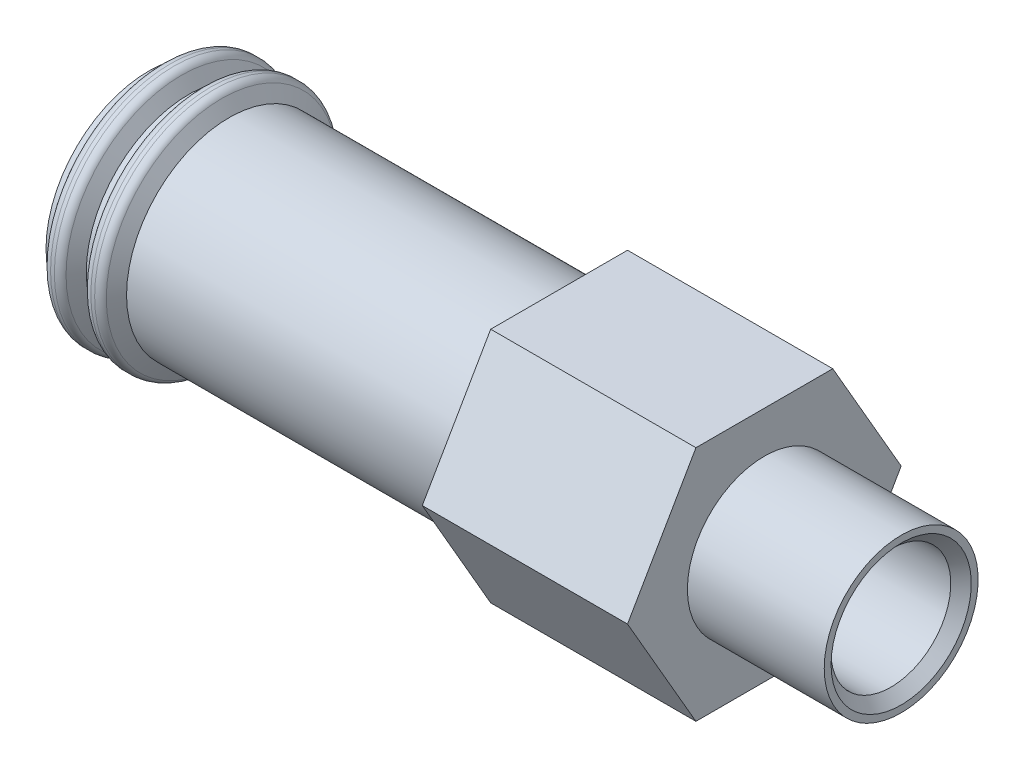
ISO-10303-21;
HEADER;
FILE_DESCRIPTION(('STEP AP214'),'2;1');
FILE_NAME('part.step','',(''),(''),'','','');
FILE_SCHEMA(('AUTOMOTIVE_DESIGN { 1 0 10303 214 1 1 1 1 }'));
ENDSEC;
DATA;
#1=APPLICATION_CONTEXT('core data for automotive mechanical design processes');
#2=APPLICATION_PROTOCOL_DEFINITION('international standard','automotive_design',2000,#1);
#3=PRODUCT_CONTEXT('',#1,'mechanical');
#4=PRODUCT('Part','Part','',(#3));
#5=PRODUCT_RELATED_PRODUCT_CATEGORY('part','',(#4));
#6=PRODUCT_DEFINITION_FORMATION('','',#4);
#7=PRODUCT_DEFINITION_CONTEXT('part definition',#1,'design');
#8=PRODUCT_DEFINITION('design','',#6,#7);
#9=PRODUCT_DEFINITION_SHAPE('','',#8);
#10=(LENGTH_UNIT() NAMED_UNIT(*) SI_UNIT(.MILLI.,.METRE.));
#11=(NAMED_UNIT(*) PLANE_ANGLE_UNIT() SI_UNIT($,.RADIAN.));
#12=(NAMED_UNIT(*) SI_UNIT($,.STERADIAN.) SOLID_ANGLE_UNIT());
#13=UNCERTAINTY_MEASURE_WITH_UNIT(LENGTH_MEASURE(1.E-05),#10,'distance_accuracy_value','');
#14=(GEOMETRIC_REPRESENTATION_CONTEXT(3) GLOBAL_UNCERTAINTY_ASSIGNED_CONTEXT((#13)) GLOBAL_UNIT_ASSIGNED_CONTEXT((#10,
#11,#12)) REPRESENTATION_CONTEXT('',''));
#15=CARTESIAN_POINT('',(0.,0.,0.));
#16=DIRECTION('',(0.,0.,1.));
#17=DIRECTION('',(1.,0.,0.));
#18=AXIS2_PLACEMENT_3D('',#15,#16,#17);
#19=CARTESIAN_POINT('',(3.5,4.,0.));
#20=DIRECTION('',(-1.,0.,0.));
#21=DIRECTION('',(0.,0.,1.));
#22=AXIS2_PLACEMENT_3D('',#19,#20,#21);
#23=PLANE('',#22);
#24=CARTESIAN_POINT('',(3.5,0.,0.));
#25=DIRECTION('',(-1.,0.,0.));
#26=DIRECTION('',(0.,0.,1.));
#27=AXIS2_PLACEMENT_3D('',#24,#25,#26);
#28=CIRCLE('',#27,2.25);
#29=CARTESIAN_POINT('',(3.5,0.,2.25));
#30=VERTEX_POINT('',#29);
#31=EDGE_CURVE('E144',#30,#30,#28,.T.);
#32=ORIENTED_EDGE('',*,*,#31,.T.);
#33=EDGE_LOOP('',(#32));
#34=FACE_BOUND('',#33,.T.);
#35=DIRECTION('',(0.,0.866025403784438,0.500000000000001));
#36=VECTOR('',#35,1.);
#37=CARTESIAN_POINT('',(3.5,1.73205080756888,-3.));
#38=LINE('',#37,#36);
#39=CARTESIAN_POINT('',(3.5,0.,-4.));
#40=VERTEX_POINT('',#39);
#41=CARTESIAN_POINT('',(3.5,3.46410161513776,-1.99999999999999));
#42=VERTEX_POINT('',#41);
#43=EDGE_CURVE('E110',#40,#42,#38,.T.);
#44=ORIENTED_EDGE('',*,*,#43,.T.);
#45=DIRECTION('',(0.,0.,1.));
#46=VECTOR('',#45,1.);
#47=CARTESIAN_POINT('',(3.5,3.46410161513775,0.));
#48=LINE('',#47,#46);
#49=CARTESIAN_POINT('',(3.5,3.46410161513775,2.00000000000002));
#50=VERTEX_POINT('',#49);
#51=EDGE_CURVE('E118',#42,#50,#48,.T.);
#52=ORIENTED_EDGE('',*,*,#51,.T.);
#53=DIRECTION('',(0.,-0.866025403784442,0.499999999999995));
#54=VECTOR('',#53,1.);
#55=CARTESIAN_POINT('',(3.5,1.73205080756886,3.00000000000001));
#56=LINE('',#55,#54);
#57=CARTESIAN_POINT('',(3.5,0.,4.));
#58=VERTEX_POINT('',#57);
#59=EDGE_CURVE('E62',#50,#58,#56,.T.);
#60=ORIENTED_EDGE('',*,*,#59,.T.);
#61=DIRECTION('',(0.,-0.866025403784435,-0.500000000000007));
#62=VECTOR('',#61,1.);
#63=CARTESIAN_POINT('',(3.5,-1.7320508075689,2.99999999999998));
#64=LINE('',#63,#62);
#65=CARTESIAN_POINT('',(3.5,-3.46410161513777,1.99999999999997));
#66=VERTEX_POINT('',#65);
#67=EDGE_CURVE('E498',#58,#66,#64,.T.);
#68=ORIENTED_EDGE('',*,*,#67,.T.);
#69=DIRECTION('',(0.,0.,-1.));
#70=VECTOR('',#69,1.);
#71=CARTESIAN_POINT('',(3.5,-3.46410161513775,0.));
#72=LINE('',#71,#70);
#73=CARTESIAN_POINT('',(3.5,-3.46410161513773,-2.00000000000004));
#74=VERTEX_POINT('',#73);
#75=EDGE_CURVE('E487',#66,#74,#72,.T.);
#76=ORIENTED_EDGE('',*,*,#75,.T.);
#77=DIRECTION('',(0.,0.866025403784442,-0.499999999999995));
#78=VECTOR('',#77,1.);
#79=CARTESIAN_POINT('',(3.5,-1.73205080756887,-3.00000000000002));
#80=LINE('',#79,#78);
#81=EDGE_CURVE('E480',#74,#40,#80,.T.);
#82=ORIENTED_EDGE('',*,*,#81,.T.);
#83=EDGE_LOOP('',(#44,#52,#60,#68,#76,#82));
#84=FACE_BOUND('',#83,.T.);
#85=ADVANCED_FACE('F47',(#34,#84),#23,.F.);
#86=CARTESIAN_POINT('',(-2.5,3.,0.));
#87=DIRECTION('',(1.,0.,0.));
#88=DIRECTION('',(0.,0.,-1.));
#89=AXIS2_PLACEMENT_3D('',#86,#87,#88);
#90=PLANE('',#89);
#91=CARTESIAN_POINT('',(-2.5,0.,0.));
#92=DIRECTION('',(-1.,0.,0.));
#93=DIRECTION('',(0.,0.,1.));
#94=AXIS2_PLACEMENT_3D('',#91,#92,#93);
#95=CIRCLE('',#94,3.);
#96=CARTESIAN_POINT('',(-2.5,0.,3.));
#97=VERTEX_POINT('',#96);
#98=EDGE_CURVE('E141',#97,#97,#95,.T.);
#99=ORIENTED_EDGE('',*,*,#98,.F.);
#100=EDGE_LOOP('',(#99));
#101=FACE_BOUND('',#100,.T.);
#102=DIRECTION('',(0.,-0.866025403784438,-0.500000000000001));
#103=VECTOR('',#102,1.);
#104=CARTESIAN_POINT('',(-2.5,1.73205080756888,-3.));
#105=LINE('',#104,#103);
#106=CARTESIAN_POINT('',(-2.5,3.46410161513776,-1.99999999999999));
#107=VERTEX_POINT('',#106);
#108=CARTESIAN_POINT('',(-2.5,0.,-4.));
#109=VERTEX_POINT('',#108);
#110=EDGE_CURVE('E99',#107,#109,#105,.T.);
#111=ORIENTED_EDGE('',*,*,#110,.T.);
#112=DIRECTION('',(0.,-0.866025403784442,0.499999999999995));
#113=VECTOR('',#112,1.);
#114=CARTESIAN_POINT('',(-2.5,-1.73205080756887,-3.00000000000002));
#115=LINE('',#114,#113);
#116=CARTESIAN_POINT('',(-2.5,-3.46410161513773,-2.00000000000004));
#117=VERTEX_POINT('',#116);
#118=EDGE_CURVE('E482',#109,#117,#115,.T.);
#119=ORIENTED_EDGE('',*,*,#118,.T.);
#120=DIRECTION('',(0.,0.,1.));
#121=VECTOR('',#120,1.);
#122=CARTESIAN_POINT('',(-2.5,-3.46410161513775,0.));
#123=LINE('',#122,#121);
#124=CARTESIAN_POINT('',(-2.5,-3.46410161513777,1.99999999999997));
#125=VERTEX_POINT('',#124);
#126=EDGE_CURVE('E483',#117,#125,#123,.T.);
#127=ORIENTED_EDGE('',*,*,#126,.T.);
#128=DIRECTION('',(0.,0.866025403784435,0.500000000000007));
#129=VECTOR('',#128,1.);
#130=CARTESIAN_POINT('',(-2.5,-1.7320508075689,2.99999999999998));
#131=LINE('',#130,#129);
#132=CARTESIAN_POINT('',(-2.5,0.,4.));
#133=VERTEX_POINT('',#132);
#134=EDGE_CURVE('E496',#125,#133,#131,.T.);
#135=ORIENTED_EDGE('',*,*,#134,.T.);
#136=DIRECTION('',(0.,0.866025403784442,-0.499999999999995));
#137=VECTOR('',#136,1.);
#138=CARTESIAN_POINT('',(-2.5,1.73205080756886,3.00000000000001));
#139=LINE('',#138,#137);
#140=CARTESIAN_POINT('',(-2.5,3.46410161513775,2.00000000000002));
#141=VERTEX_POINT('',#140);
#142=EDGE_CURVE('E122',#133,#141,#139,.T.);
#143=ORIENTED_EDGE('',*,*,#142,.T.);
#144=DIRECTION('',(0.,0.,-1.));
#145=VECTOR('',#144,1.);
#146=CARTESIAN_POINT('',(-2.5,3.46410161513775,0.));
#147=LINE('',#146,#145);
#148=EDGE_CURVE('E116',#141,#107,#147,.T.);
#149=ORIENTED_EDGE('',*,*,#148,.T.);
#150=EDGE_LOOP('',(#111,#119,#127,#135,#143,#149));
#151=FACE_BOUND('',#150,.T.);
#152=ADVANCED_FACE('F120',(#101,#151),#90,.F.);
#153=CARTESIAN_POINT('',(-29.7219053344211,0.,0.));
#154=DIRECTION('',(-1.,0.,0.));
#155=DIRECTION('',(0.,0.,1.));
#156=AXIS2_PLACEMENT_3D('',#153,#154,#155);
#157=CYLINDRICAL_SURFACE('',#156,3.);
#158=CARTESIAN_POINT('',(-14.5,0.,0.));
#159=DIRECTION('',(-1.,0.,0.));
#160=DIRECTION('',(0.,0.,1.));
#161=AXIS2_PLACEMENT_3D('',#158,#159,#160);
#162=CIRCLE('',#161,3.);
#163=CARTESIAN_POINT('',(-14.5,0.,3.));
#164=VERTEX_POINT('',#163);
#165=EDGE_CURVE('E159',#164,#164,#162,.T.);
#166=ORIENTED_EDGE('',*,*,#165,.F.);
#167=EDGE_LOOP('',(#166));
#168=FACE_BOUND('',#167,.T.);
#169=CARTESIAN_POINT('',(-14.3,0.,0.));
#170=DIRECTION('',(-1.,0.,0.));
#171=DIRECTION('',(0.,0.,1.));
#172=AXIS2_PLACEMENT_3D('',#169,#170,#171);
#173=CIRCLE('',#172,3.);
#174=CARTESIAN_POINT('',(-14.3,0.,3.));
#175=VERTEX_POINT('',#174);
#176=EDGE_CURVE('E129',#175,#175,#173,.T.);
#177=ORIENTED_EDGE('',*,*,#176,.T.);
#178=EDGE_LOOP('',(#177));
#179=FACE_BOUND('',#178,.T.);
#180=ADVANCED_FACE('F206',(#168,#179),#157,.T.);
#181=CARTESIAN_POINT('',(-14.5,2.5,0.));
#182=DIRECTION('',(1.,0.,0.));
#183=DIRECTION('',(0.,0.,-1.));
#184=AXIS2_PLACEMENT_3D('',#181,#182,#183);
#185=PLANE('',#184);
#186=CARTESIAN_POINT('',(-14.5,0.,0.));
#187=DIRECTION('',(-1.,0.,0.));
#188=DIRECTION('',(0.,0.,1.));
#189=AXIS2_PLACEMENT_3D('',#186,#187,#188);
#190=CIRCLE('',#189,2.5);
#191=CARTESIAN_POINT('',(-14.5,0.,2.5));
#192=VERTEX_POINT('',#191);
#193=EDGE_CURVE('E156',#192,#192,#190,.T.);
#194=ORIENTED_EDGE('',*,*,#193,.F.);
#195=EDGE_LOOP('',(#194));
#196=FACE_BOUND('',#195,.T.);
#197=ORIENTED_EDGE('',*,*,#165,.T.);
#198=EDGE_LOOP('',(#197));
#199=FACE_BOUND('',#198,.T.);
#200=ADVANCED_FACE('F230',(#196,#199),#185,.F.);
#201=CARTESIAN_POINT('',(-29.7219053344211,0.,0.));
#202=DIRECTION('',(-1.,0.,0.));
#203=DIRECTION('',(0.,0.,1.));
#204=AXIS2_PLACEMENT_3D('',#201,#202,#203);
#205=CYLINDRICAL_SURFACE('',#204,2.5);
#206=CARTESIAN_POINT('',(-10.5,0.,0.));
#207=DIRECTION('',(-1.,0.,0.));
#208=DIRECTION('',(0.,0.,1.));
#209=AXIS2_PLACEMENT_3D('',#206,#207,#208);
#210=CIRCLE('',#209,2.5);
#211=CARTESIAN_POINT('',(-10.5,0.,2.5));
#212=VERTEX_POINT('',#211);
#213=EDGE_CURVE('E153',#212,#212,#210,.T.);
#214=ORIENTED_EDGE('',*,*,#213,.F.);
#215=EDGE_LOOP('',(#214));
#216=FACE_BOUND('',#215,.T.);
#217=ORIENTED_EDGE('',*,*,#193,.T.);
#218=EDGE_LOOP('',(#217));
#219=FACE_BOUND('',#218,.T.);
#220=ADVANCED_FACE('F226',(#216,#219),#205,.F.);
#221=CARTESIAN_POINT('',(-10.5,0.,0.));
#222=DIRECTION('',(-1.,0.,0.));
#223=DIRECTION('',(0.,0.,1.));
#224=AXIS2_PLACEMENT_3D('',#221,#222,#223);
#225=CONICAL_SURFACE('',#224,2.5,0.523598775598293);
#226=CARTESIAN_POINT('',(-9.20096189432332,0.,0.));
#227=DIRECTION('',(-1.,0.,0.));
#228=DIRECTION('',(0.,0.,1.));
#229=AXIS2_PLACEMENT_3D('',#226,#227,#228);
#230=CIRCLE('',#229,1.75);
#231=CARTESIAN_POINT('',(-9.20096189432332,0.,1.75));
#232=VERTEX_POINT('',#231);
#233=EDGE_CURVE('E150',#232,#232,#230,.T.);
#234=ORIENTED_EDGE('',*,*,#233,.F.);
#235=EDGE_LOOP('',(#234));
#236=FACE_BOUND('',#235,.T.);
#237=ORIENTED_EDGE('',*,*,#213,.T.);
#238=EDGE_LOOP('',(#237));
#239=FACE_BOUND('',#238,.T.);
#240=ADVANCED_FACE('F222',(#236,#239),#225,.F.);
#241=CARTESIAN_POINT('',(-29.7219053344211,0.,0.));
#242=DIRECTION('',(-1.,0.,0.));
#243=DIRECTION('',(0.,0.,1.));
#244=AXIS2_PLACEMENT_3D('',#241,#242,#243);
#245=CYLINDRICAL_SURFACE('',#244,1.75);
#246=CARTESIAN_POINT('',(7.2,0.,0.));
#247=DIRECTION('',(-1.,0.,0.));
#248=DIRECTION('',(0.,0.,1.));
#249=AXIS2_PLACEMENT_3D('',#246,#247,#248);
#250=CIRCLE('',#249,1.75);
#251=CARTESIAN_POINT('',(7.2,0.,1.75));
#252=VERTEX_POINT('',#251);
#253=EDGE_CURVE('E12',#252,#252,#250,.F.);
#254=ORIENTED_EDGE('',*,*,#253,.T.);
#255=EDGE_LOOP('',(#254));
#256=FACE_BOUND('',#255,.T.);
#257=ORIENTED_EDGE('',*,*,#233,.T.);
#258=EDGE_LOOP('',(#257));
#259=FACE_BOUND('',#258,.T.);
#260=ADVANCED_FACE('F219',(#256,#259),#245,.F.);
#261=CARTESIAN_POINT('',(7.5,2.25,0.));
#262=DIRECTION('',(-1.,0.,0.));
#263=DIRECTION('',(0.,0.,1.));
#264=AXIS2_PLACEMENT_3D('',#261,#262,#263);
#265=PLANE('',#264);
#266=CARTESIAN_POINT('',(7.5,0.,0.));
#267=DIRECTION('',(-1.,0.,0.));
#268=DIRECTION('',(0.,0.,1.));
#269=AXIS2_PLACEMENT_3D('',#266,#267,#268);
#270=CIRCLE('',#269,2.05);
#271=CARTESIAN_POINT('',(7.5,0.,2.05));
#272=VERTEX_POINT('',#271);
#273=EDGE_CURVE('E55',#272,#272,#270,.T.);
#274=ORIENTED_EDGE('',*,*,#273,.T.);
#275=EDGE_LOOP('',(#274));
#276=FACE_BOUND('',#275,.T.);
#277=CARTESIAN_POINT('',(7.5,0.,0.));
#278=DIRECTION('',(-1.,0.,0.));
#279=DIRECTION('',(0.,0.,1.));
#280=AXIS2_PLACEMENT_3D('',#277,#278,#279);
#281=CIRCLE('',#280,2.25);
#282=CARTESIAN_POINT('',(7.5,0.,2.25));
#283=VERTEX_POINT('',#282);
#284=EDGE_CURVE('E147',#283,#283,#281,.T.);
#285=ORIENTED_EDGE('',*,*,#284,.F.);
#286=EDGE_LOOP('',(#285));
#287=FACE_BOUND('',#286,.T.);
#288=ADVANCED_FACE('F188',(#276,#287),#265,.F.);
#289=CARTESIAN_POINT('',(-29.7219053344211,0.,0.));
#290=DIRECTION('',(-1.,0.,0.));
#291=DIRECTION('',(0.,0.,1.));
#292=AXIS2_PLACEMENT_3D('',#289,#290,#291);
#293=CYLINDRICAL_SURFACE('',#292,2.25);
#294=ORIENTED_EDGE('',*,*,#31,.F.);
#295=EDGE_LOOP('',(#294));
#296=FACE_BOUND('',#295,.T.);
#297=ORIENTED_EDGE('',*,*,#284,.T.);
#298=EDGE_LOOP('',(#297));
#299=FACE_BOUND('',#298,.T.);
#300=ADVANCED_FACE('F212',(#296,#299),#293,.T.);
#301=CARTESIAN_POINT('',(-29.7219053344211,0.,0.));
#302=DIRECTION('',(-1.,0.,0.));
#303=DIRECTION('',(0.,0.,1.));
#304=AXIS2_PLACEMENT_3D('',#301,#302,#303);
#305=CYLINDRICAL_SURFACE('',#304,3.);
#306=CARTESIAN_POINT('',(-12.1452994616208,0.,0.));
#307=DIRECTION('',(-1.,0.,0.));
#308=DIRECTION('',(0.,0.,1.));
#309=AXIS2_PLACEMENT_3D('',#306,#307,#308);
#310=CIRCLE('',#309,3.);
#311=CARTESIAN_POINT('',(-12.1452994616208,0.,3.));
#312=VERTEX_POINT('',#311);
#313=EDGE_CURVE('E138',#312,#312,#310,.T.);
#314=ORIENTED_EDGE('',*,*,#313,.F.);
#315=EDGE_LOOP('',(#314));
#316=FACE_BOUND('',#315,.T.);
#317=ORIENTED_EDGE('',*,*,#98,.T.);
#318=EDGE_LOOP('',(#317));
#319=FACE_BOUND('',#318,.T.);
#320=ADVANCED_FACE('F215',(#316,#319),#305,.T.);
#321=CARTESIAN_POINT('',(-12.1452994616208,0.,0.));
#322=DIRECTION('',(-1.,0.,0.));
#323=DIRECTION('',(0.,0.,1.));
#324=AXIS2_PLACEMENT_3D('',#321,#322,#323);
#325=CONICAL_SURFACE('',#324,3.,1.0471975511966);
#326=CARTESIAN_POINT('',(-12.3618058125669,0.,0.));
#327=DIRECTION('',(1.,0.,0.));
#328=DIRECTION('',(0.,0.,-1.));
#329=AXIS2_PLACEMENT_3D('',#326,#327,#328);
#330=CIRCLE('',#329,3.375);
#331=CARTESIAN_POINT('',(-12.3618058125669,0.,-3.375));
#332=VERTEX_POINT('',#331);
#333=EDGE_CURVE('E183',#332,#332,#330,.T.);
#334=ORIENTED_EDGE('',*,*,#333,.T.);
#335=EDGE_LOOP('',(#334));
#336=FACE_BOUND('',#335,.T.);
#337=ORIENTED_EDGE('',*,*,#313,.T.);
#338=EDGE_LOOP('',(#337));
#339=FACE_BOUND('',#338,.T.);
#340=ADVANCED_FACE('F277',(#336,#339),#325,.T.);
#341=CARTESIAN_POINT('',(-29.7219053344211,0.,0.));
#342=DIRECTION('',(-1.,0.,0.));
#343=DIRECTION('',(0.,0.,1.));
#344=AXIS2_PLACEMENT_3D('',#341,#342,#343);
#345=CYLINDRICAL_SURFACE('',#344,3.5);
#346=CARTESIAN_POINT('',(-12.6896370289182,0.,0.));
#347=DIRECTION('',(1.,0.,0.));
#348=DIRECTION('',(0.,0.,-1.));
#349=AXIS2_PLACEMENT_3D('',#346,#347,#348);
#350=CIRCLE('',#349,3.5);
#351=CARTESIAN_POINT('',(-12.6896370289182,0.,-3.5));
#352=VERTEX_POINT('',#351);
#353=EDGE_CURVE('E180',#352,#352,#350,.T.);
#354=ORIENTED_EDGE('',*,*,#353,.T.);
#355=EDGE_LOOP('',(#354));
#356=FACE_BOUND('',#355,.T.);
#357=CARTESIAN_POINT('',(-12.578312163513,0.,0.));
#358=DIRECTION('',(1.,0.,0.));
#359=DIRECTION('',(0.,0.,-1.));
#360=AXIS2_PLACEMENT_3D('',#357,#358,#359);
#361=CIRCLE('',#360,3.5);
#362=CARTESIAN_POINT('',(-12.578312163513,0.,-3.5));
#363=VERTEX_POINT('',#362);
#364=EDGE_CURVE('E177',#363,#363,#361,.F.);
#365=ORIENTED_EDGE('',*,*,#364,.T.);
#366=EDGE_LOOP('',(#365));
#367=FACE_BOUND('',#366,.T.);
#368=ADVANCED_FACE('F258',(#356,#367),#345,.T.);
#369=CARTESIAN_POINT('',(-12.8339745962156,0.,0.));
#370=DIRECTION('',(1.,0.,0.));
#371=DIRECTION('',(0.,0.,-1.));
#372=AXIS2_PLACEMENT_3D('',#369,#370,#371);
#373=CONICAL_SURFACE('',#372,3.5,1.0471975511966);
#374=CARTESIAN_POINT('',(-12.9061433798643,0.,0.));
#375=DIRECTION('',(-1.,0.,0.));
#376=DIRECTION('',(0.,0.,1.));
#377=AXIS2_PLACEMENT_3D('',#374,#375,#376);
#378=CIRCLE('',#377,3.375);
#379=CARTESIAN_POINT('',(-12.9061433798643,0.,3.375));
#380=VERTEX_POINT('',#379);
#381=EDGE_CURVE('E174',#380,#380,#378,.T.);
#382=ORIENTED_EDGE('',*,*,#381,.T.);
#383=EDGE_LOOP('',(#382));
#384=FACE_BOUND('',#383,.T.);
#385=CARTESIAN_POINT('',(-13.1226497308104,0.,0.));
#386=DIRECTION('',(-1.,0.,0.));
#387=DIRECTION('',(0.,0.,1.));
#388=AXIS2_PLACEMENT_3D('',#385,#386,#387);
#389=CIRCLE('',#388,3.);
#390=CARTESIAN_POINT('',(-13.1226497308104,0.,3.));
#391=VERTEX_POINT('',#390);
#392=EDGE_CURVE('E135',#391,#391,#389,.T.);
#393=ORIENTED_EDGE('',*,*,#392,.F.);
#394=EDGE_LOOP('',(#393));
#395=FACE_BOUND('',#394,.T.);
#396=ADVANCED_FACE('F254',(#384,#395),#373,.T.);
#397=CARTESIAN_POINT('',(-29.7219053344211,0.,0.));
#398=DIRECTION('',(-1.,0.,0.));
#399=DIRECTION('',(0.,0.,1.));
#400=AXIS2_PLACEMENT_3D('',#397,#398,#399);
#401=CYLINDRICAL_SURFACE('',#400,3.);
#402=CARTESIAN_POINT('',(-13.3226497308104,0.,0.));
#403=DIRECTION('',(-1.,0.,0.));
#404=DIRECTION('',(0.,0.,1.));
#405=AXIS2_PLACEMENT_3D('',#402,#403,#404);
#406=CIRCLE('',#405,3.);
#407=CARTESIAN_POINT('',(-13.3226497308104,0.,3.));
#408=VERTEX_POINT('',#407);
#409=EDGE_CURVE('E132',#408,#408,#406,.T.);
#410=ORIENTED_EDGE('',*,*,#409,.F.);
#411=EDGE_LOOP('',(#410));
#412=FACE_BOUND('',#411,.T.);
#413=ORIENTED_EDGE('',*,*,#392,.T.);
#414=EDGE_LOOP('',(#413));
#415=FACE_BOUND('',#414,.T.);
#416=ADVANCED_FACE('F257',(#412,#415),#401,.T.);
#417=CARTESIAN_POINT('',(-13.3226497308104,0.,0.));
#418=DIRECTION('',(-1.,0.,0.));
#419=DIRECTION('',(0.,0.,1.));
#420=AXIS2_PLACEMENT_3D('',#417,#418,#419);
#421=CONICAL_SURFACE('',#420,3.,1.0471975511966);
#422=CARTESIAN_POINT('',(-13.5391560817565,0.,0.));
#423=DIRECTION('',(1.,0.,0.));
#424=DIRECTION('',(0.,0.,-1.));
#425=AXIS2_PLACEMENT_3D('',#422,#423,#424);
#426=CIRCLE('',#425,3.375);
#427=CARTESIAN_POINT('',(-13.5391560817565,0.,-3.375));
#428=VERTEX_POINT('',#427);
#429=EDGE_CURVE('E168',#428,#428,#426,.T.);
#430=ORIENTED_EDGE('',*,*,#429,.T.);
#431=EDGE_LOOP('',(#430));
#432=FACE_BOUND('',#431,.T.);
#433=ORIENTED_EDGE('',*,*,#409,.T.);
#434=EDGE_LOOP('',(#433));
#435=FACE_BOUND('',#434,.T.);
#436=ADVANCED_FACE('F263',(#432,#435),#421,.T.);
#437=CARTESIAN_POINT('',(-29.7219053344211,0.,0.));
#438=DIRECTION('',(-1.,0.,0.));
#439=DIRECTION('',(0.,0.,1.));
#440=AXIS2_PLACEMENT_3D('',#437,#438,#439);
#441=CYLINDRICAL_SURFACE('',#440,3.5);
#442=CARTESIAN_POINT('',(-13.7556624327026,0.,0.));
#443=DIRECTION('',(1.,0.,0.));
#444=DIRECTION('',(0.,0.,-1.));
#445=AXIS2_PLACEMENT_3D('',#442,#443,#444);
#446=CIRCLE('',#445,3.5);
#447=CARTESIAN_POINT('',(-13.7556624327026,0.,-3.5));
#448=VERTEX_POINT('',#447);
#449=EDGE_CURVE('E165',#448,#448,#446,.F.);
#450=ORIENTED_EDGE('',*,*,#449,.T.);
#451=EDGE_LOOP('',(#450));
#452=FACE_BOUND('',#451,.T.);
#453=CARTESIAN_POINT('',(-13.8669872981078,0.,0.));
#454=DIRECTION('',(1.,0.,0.));
#455=DIRECTION('',(0.,0.,-1.));
#456=AXIS2_PLACEMENT_3D('',#453,#454,#455);
#457=CIRCLE('',#456,3.5);
#458=CARTESIAN_POINT('',(-13.8669872981078,0.,-3.5));
#459=VERTEX_POINT('',#458);
#460=EDGE_CURVE('E162',#459,#459,#457,.T.);
#461=ORIENTED_EDGE('',*,*,#460,.T.);
#462=EDGE_LOOP('',(#461));
#463=FACE_BOUND('',#462,.T.);
#464=ADVANCED_FACE('F269',(#452,#463),#441,.T.);
#465=CARTESIAN_POINT('',(-14.0113248654052,0.,0.));
#466=DIRECTION('',(1.,0.,0.));
#467=DIRECTION('',(0.,0.,-1.));
#468=AXIS2_PLACEMENT_3D('',#465,#466,#467);
#469=CONICAL_SURFACE('',#468,3.5,1.04719755119659);
#470=CARTESIAN_POINT('',(-14.0834936490539,0.,0.));
#471=DIRECTION('',(-1.,0.,0.));
#472=DIRECTION('',(0.,0.,1.));
#473=AXIS2_PLACEMENT_3D('',#470,#471,#472);
#474=CIRCLE('',#473,3.375);
#475=CARTESIAN_POINT('',(-14.0834936490539,0.,3.375));
#476=VERTEX_POINT('',#475);
#477=EDGE_CURVE('E171',#476,#476,#474,.T.);
#478=ORIENTED_EDGE('',*,*,#477,.T.);
#479=EDGE_LOOP('',(#478));
#480=FACE_BOUND('',#479,.T.);
#481=ORIENTED_EDGE('',*,*,#176,.F.);
#482=EDGE_LOOP('',(#481));
#483=FACE_BOUND('',#482,.T.);
#484=ADVANCED_FACE('F385',(#480,#483),#469,.T.);
#485=CARTESIAN_POINT('',(-14.501,3.46410161513775,0.));
#486=DIRECTION('',(0.,1.,0.));
#487=DIRECTION('',(0.,0.,1.));
#488=AXIS2_PLACEMENT_3D('',#485,#486,#487);
#489=PLANE('',#488);
#490=DIRECTION('',(1.,0.,0.));
#491=VECTOR('',#490,1.);
#492=CARTESIAN_POINT('',(-14.501,3.46410161513775,2.00000000000002));
#493=LINE('',#492,#491);
#494=EDGE_CURVE('E67',#141,#50,#493,.T.);
#495=ORIENTED_EDGE('',*,*,#494,.T.);
#496=ORIENTED_EDGE('',*,*,#51,.F.);
#497=DIRECTION('',(1.,0.,0.));
#498=VECTOR('',#497,1.);
#499=CARTESIAN_POINT('',(-14.501,3.46410161513776,-1.99999999999999));
#500=LINE('',#499,#498);
#501=EDGE_CURVE('E102',#107,#42,#500,.T.);
#502=ORIENTED_EDGE('',*,*,#501,.F.);
#503=ORIENTED_EDGE('',*,*,#148,.F.);
#504=EDGE_LOOP('',(#495,#496,#502,#503));
#505=FACE_BOUND('',#504,.T.);
#506=ADVANCED_FACE('F115',(#505),#489,.T.);
#507=CARTESIAN_POINT('',(-14.501,1.73205080756886,3.00000000000001));
#508=DIRECTION('',(0.,0.499999999999995,0.866025403784441));
#509=DIRECTION('',(0.,-0.866025403784442,0.499999999999995));
#510=AXIS2_PLACEMENT_3D('',#507,#508,#509);
#511=PLANE('',#510);
#512=DIRECTION('',(1.,0.,0.));
#513=VECTOR('',#512,1.);
#514=CARTESIAN_POINT('',(-14.501,0.,4.));
#515=LINE('',#514,#513);
#516=EDGE_CURVE('E123',#133,#58,#515,.T.);
#517=ORIENTED_EDGE('',*,*,#516,.T.);
#518=ORIENTED_EDGE('',*,*,#59,.F.);
#519=ORIENTED_EDGE('',*,*,#494,.F.);
#520=ORIENTED_EDGE('',*,*,#142,.F.);
#521=EDGE_LOOP('',(#517,#518,#519,#520));
#522=FACE_BOUND('',#521,.T.);
#523=ADVANCED_FACE('F384',(#522),#511,.T.);
#524=CARTESIAN_POINT('',(-14.501,-1.7320508075689,2.99999999999998));
#525=DIRECTION('',(0.,-0.500000000000007,0.866025403784435));
#526=DIRECTION('',(0.,-0.866025403784435,-0.500000000000007));
#527=AXIS2_PLACEMENT_3D('',#524,#525,#526);
#528=PLANE('',#527);
#529=DIRECTION('',(1.,0.,0.));
#530=VECTOR('',#529,1.);
#531=CARTESIAN_POINT('',(-14.501,-3.46410161513777,1.99999999999997));
#532=LINE('',#531,#530);
#533=EDGE_CURVE('E500',#125,#66,#532,.T.);
#534=ORIENTED_EDGE('',*,*,#533,.T.);
#535=ORIENTED_EDGE('',*,*,#67,.F.);
#536=ORIENTED_EDGE('',*,*,#516,.F.);
#537=ORIENTED_EDGE('',*,*,#134,.F.);
#538=EDGE_LOOP('',(#534,#535,#536,#537));
#539=FACE_BOUND('',#538,.T.);
#540=ADVANCED_FACE('F395',(#539),#528,.T.);
#541=CARTESIAN_POINT('',(-14.501,-3.46410161513775,0.));
#542=DIRECTION('',(0.,-1.,0.));
#543=DIRECTION('',(0.,0.,-1.));
#544=AXIS2_PLACEMENT_3D('',#541,#542,#543);
#545=PLANE('',#544);
#546=DIRECTION('',(1.,0.,0.));
#547=VECTOR('',#546,1.);
#548=CARTESIAN_POINT('',(-14.501,-3.46410161513773,-2.00000000000004));
#549=LINE('',#548,#547);
#550=EDGE_CURVE('E494',#117,#74,#549,.T.);
#551=ORIENTED_EDGE('',*,*,#550,.T.);
#552=ORIENTED_EDGE('',*,*,#75,.F.);
#553=ORIENTED_EDGE('',*,*,#533,.F.);
#554=ORIENTED_EDGE('',*,*,#126,.F.);
#555=EDGE_LOOP('',(#551,#552,#553,#554));
#556=FACE_BOUND('',#555,.T.);
#557=ADVANCED_FACE('F404',(#556),#545,.T.);
#558=CARTESIAN_POINT('',(-14.501,-1.73205080756887,-3.00000000000002));
#559=DIRECTION('',(0.,-0.499999999999995,-0.866025403784442));
#560=DIRECTION('',(0.,0.866025403784442,-0.499999999999995));
#561=AXIS2_PLACEMENT_3D('',#558,#559,#560);
#562=PLANE('',#561);
#563=DIRECTION('',(1.,0.,0.));
#564=VECTOR('',#563,1.);
#565=CARTESIAN_POINT('',(-14.501,0.,-4.));
#566=LINE('',#565,#564);
#567=EDGE_CURVE('E105',#109,#40,#566,.T.);
#568=ORIENTED_EDGE('',*,*,#567,.T.);
#569=ORIENTED_EDGE('',*,*,#81,.F.);
#570=ORIENTED_EDGE('',*,*,#550,.F.);
#571=ORIENTED_EDGE('',*,*,#118,.F.);
#572=EDGE_LOOP('',(#568,#569,#570,#571));
#573=FACE_BOUND('',#572,.T.);
#574=ADVANCED_FACE('F414',(#573),#562,.T.);
#575=CARTESIAN_POINT('',(-14.501,1.73205080756888,-3.));
#576=DIRECTION('',(0.,0.500000000000001,-0.866025403784438));
#577=DIRECTION('',(0.,0.866025403784438,0.500000000000001));
#578=AXIS2_PLACEMENT_3D('',#575,#576,#577);
#579=PLANE('',#578);
#580=ORIENTED_EDGE('',*,*,#501,.T.);
#581=ORIENTED_EDGE('',*,*,#43,.F.);
#582=ORIENTED_EDGE('',*,*,#567,.F.);
#583=ORIENTED_EDGE('',*,*,#110,.F.);
#584=EDGE_LOOP('',(#580,#581,#582,#583));
#585=FACE_BOUND('',#584,.T.);
#586=ADVANCED_FACE('F101',(#585),#579,.T.);
#587=CARTESIAN_POINT('',(-13.7556624327026,0.,0.));
#588=DIRECTION('',(1.,0.,0.));
#589=DIRECTION('',(0.,0.,-1.));
#590=AXIS2_PLACEMENT_3D('',#587,#588,#589);
#591=TOROIDAL_SURFACE('',#590,3.25,0.25);
#592=ORIENTED_EDGE('',*,*,#429,.F.);
#593=EDGE_LOOP('',(#592));
#594=FACE_BOUND('',#593,.T.);
#595=ORIENTED_EDGE('',*,*,#449,.F.);
#596=EDGE_LOOP('',(#595));
#597=FACE_BOUND('',#596,.T.);
#598=ADVANCED_FACE('F238',(#594,#597),#591,.T.);
#599=CARTESIAN_POINT('',(-13.8669872981078,0.,0.));
#600=DIRECTION('',(1.,0.,0.));
#601=DIRECTION('',(0.,0.,-1.));
#602=AXIS2_PLACEMENT_3D('',#599,#600,#601);
#603=TOROIDAL_SURFACE('',#602,3.25,0.25);
#604=ORIENTED_EDGE('',*,*,#460,.F.);
#605=EDGE_LOOP('',(#604));
#606=FACE_BOUND('',#605,.T.);
#607=ORIENTED_EDGE('',*,*,#477,.F.);
#608=EDGE_LOOP('',(#607));
#609=FACE_BOUND('',#608,.T.);
#610=ADVANCED_FACE('F241',(#606,#609),#603,.T.);
#611=CARTESIAN_POINT('',(-12.6896370289182,0.,0.));
#612=DIRECTION('',(1.,0.,0.));
#613=DIRECTION('',(0.,0.,-1.));
#614=AXIS2_PLACEMENT_3D('',#611,#612,#613);
#615=TOROIDAL_SURFACE('',#614,3.25,0.25);
#616=ORIENTED_EDGE('',*,*,#353,.F.);
#617=EDGE_LOOP('',(#616));
#618=FACE_BOUND('',#617,.T.);
#619=ORIENTED_EDGE('',*,*,#381,.F.);
#620=EDGE_LOOP('',(#619));
#621=FACE_BOUND('',#620,.T.);
#622=ADVANCED_FACE('F197',(#618,#621),#615,.T.);
#623=CARTESIAN_POINT('',(-12.578312163513,0.,0.));
#624=DIRECTION('',(1.,0.,0.));
#625=DIRECTION('',(0.,0.,-1.));
#626=AXIS2_PLACEMENT_3D('',#623,#624,#625);
#627=TOROIDAL_SURFACE('',#626,3.25,0.25);
#628=ORIENTED_EDGE('',*,*,#333,.F.);
#629=EDGE_LOOP('',(#628));
#630=FACE_BOUND('',#629,.T.);
#631=ORIENTED_EDGE('',*,*,#364,.F.);
#632=EDGE_LOOP('',(#631));
#633=FACE_BOUND('',#632,.T.);
#634=ADVANCED_FACE('F192',(#630,#633),#627,.T.);
#635=CARTESIAN_POINT('',(7.5,0.,0.));
#636=DIRECTION('',(1.,0.,0.));
#637=DIRECTION('',(0.,0.,-1.));
#638=AXIS2_PLACEMENT_3D('',#635,#636,#637);
#639=CONICAL_SURFACE('',#638,2.05,0.785398163397445);
#640=ORIENTED_EDGE('',*,*,#253,.F.);
#641=EDGE_LOOP('',(#640));
#642=FACE_BOUND('',#641,.T.);
#643=ORIENTED_EDGE('',*,*,#273,.F.);
#644=EDGE_LOOP('',(#643));
#645=FACE_BOUND('',#644,.T.);
#646=ADVANCED_FACE('F49',(#642,#645),#639,.F.);
#647=CLOSED_SHELL('',(#85,#152,#180,#200,#220,#240,#260,#288,#300,#320,#340,#368,#396,#416,#436,
#464,#484,#506,#523,#540,#557,#574,#586,#598,#610,#622,#634,#646));
#648=MANIFOLD_SOLID_BREP('B2',#647);
#649=ADVANCED_BREP_SHAPE_REPRESENTATION('',(#18,#648),#14);
#650=SHAPE_DEFINITION_REPRESENTATION(#9,#649);
ENDSEC;
END-ISO-10303-21;
